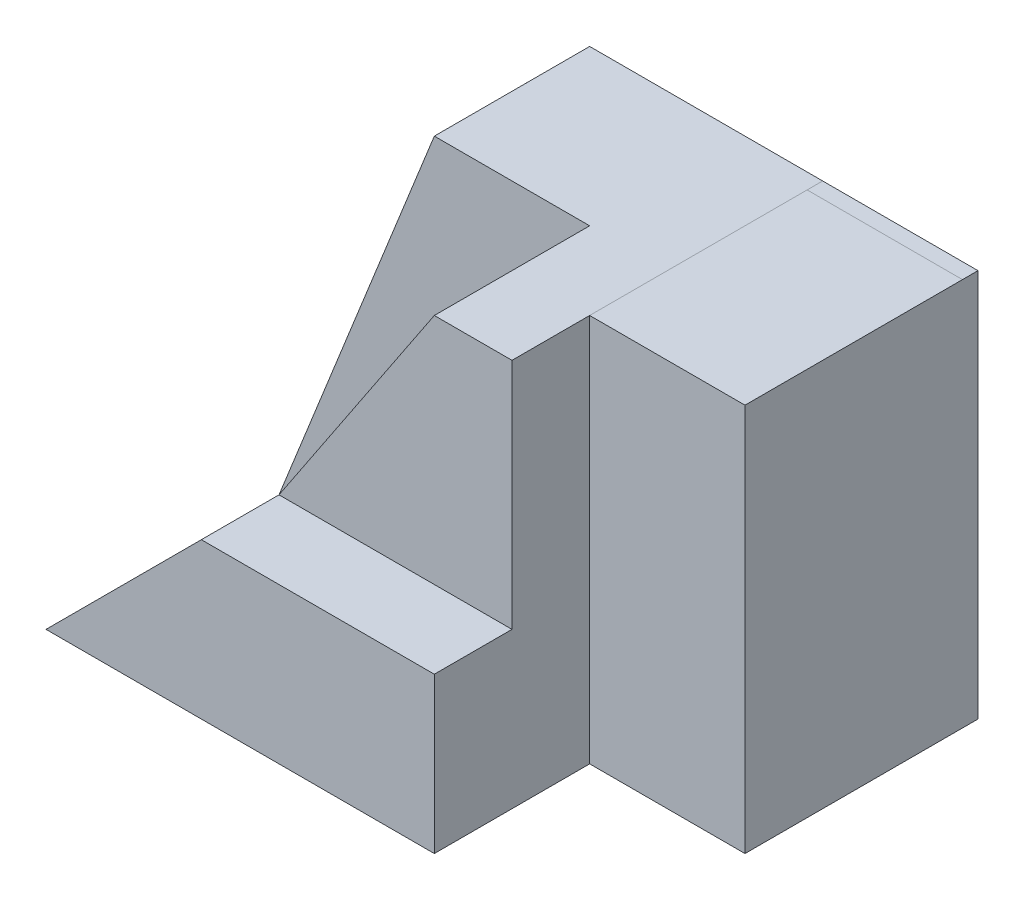
ISO-10303-21;
HEADER;
FILE_DESCRIPTION(('STEP AP214'),'2;1');
FILE_NAME('part.step','',(''),(''),'','','');
FILE_SCHEMA(('AUTOMOTIVE_DESIGN { 1 0 10303 214 1 1 1 1 }'));
ENDSEC;
DATA;
#1=APPLICATION_CONTEXT('core data for automotive mechanical design processes');
#2=APPLICATION_PROTOCOL_DEFINITION('international standard','automotive_design',2000,#1);
#3=PRODUCT_CONTEXT('',#1,'mechanical');
#4=PRODUCT('Part','Part','',(#3));
#5=PRODUCT_RELATED_PRODUCT_CATEGORY('part','',(#4));
#6=PRODUCT_DEFINITION_FORMATION('','',#4);
#7=PRODUCT_DEFINITION_CONTEXT('part definition',#1,'design');
#8=PRODUCT_DEFINITION('design','',#6,#7);
#9=PRODUCT_DEFINITION_SHAPE('','',#8);
#10=(LENGTH_UNIT() NAMED_UNIT(*) SI_UNIT(.MILLI.,.METRE.));
#11=(NAMED_UNIT(*) PLANE_ANGLE_UNIT() SI_UNIT($,.RADIAN.));
#12=(NAMED_UNIT(*) SI_UNIT($,.STERADIAN.) SOLID_ANGLE_UNIT());
#13=UNCERTAINTY_MEASURE_WITH_UNIT(LENGTH_MEASURE(1.E-05),#10,'distance_accuracy_value','');
#14=(GEOMETRIC_REPRESENTATION_CONTEXT(3) GLOBAL_UNCERTAINTY_ASSIGNED_CONTEXT((#13)) GLOBAL_UNIT_ASSIGNED_CONTEXT((#10,
#11,#12)) REPRESENTATION_CONTEXT('',''));
#15=CARTESIAN_POINT('',(0.,0.,0.));
#16=DIRECTION('',(0.,0.,1.));
#17=DIRECTION('',(1.,0.,0.));
#18=AXIS2_PLACEMENT_3D('',#15,#16,#17);
#19=CARTESIAN_POINT('',(0.,0.,50.));
#20=DIRECTION('',(0.,1.,0.));
#21=DIRECTION('',(0.,0.,1.));
#22=AXIS2_PLACEMENT_3D('',#19,#20,#21);
#23=PLANE('',#22);
#24=DIRECTION('',(-1.,0.,0.));
#25=VECTOR('',#24,1.);
#26=CARTESIAN_POINT('',(0.,0.,20.));
#27=LINE('',#26,#25);
#28=CARTESIAN_POINT('',(9.69545071876497,0.,20.));
#29=VERTEX_POINT('',#28);
#30=CARTESIAN_POINT('',(0.00628269227498889,0.,20.));
#31=VERTEX_POINT('',#30);
#32=EDGE_CURVE('E375',#29,#31,#27,.T.);
#33=ORIENTED_EDGE('',*,*,#32,.T.);
#34=DIRECTION('',(0.,0.,1.));
#35=VECTOR('',#34,1.);
#36=CARTESIAN_POINT('',(0.0062826922749892,0.,50.));
#37=LINE('',#36,#35);
#38=CARTESIAN_POINT('',(0.00628269227498889,0.,29.9987001326328));
#39=VERTEX_POINT('',#38);
#40=EDGE_CURVE('E374',#31,#39,#37,.T.);
#41=ORIENTED_EDGE('',*,*,#40,.T.);
#42=DIRECTION('',(0.979260419507103,0.,-0.202605604035952));
#43=VECTOR('',#42,1.);
#44=CARTESIAN_POINT('',(-3.96807297605473,0.,30.8209806157355));
#45=LINE('',#44,#43);
#46=CARTESIAN_POINT('',(9.69545071876497,0.,27.9940446788762));
#47=VERTEX_POINT('',#46);
#48=EDGE_CURVE('E365',#39,#47,#45,.T.);
#49=ORIENTED_EDGE('',*,*,#48,.T.);
#50=DIRECTION('',(0.,0.,1.));
#51=VECTOR('',#50,1.);
#52=CARTESIAN_POINT('',(9.69545071876497,0.,50.));
#53=LINE('',#52,#51);
#54=EDGE_CURVE('E40',#29,#47,#53,.T.);
#55=ORIENTED_EDGE('',*,*,#54,.F.);
#56=EDGE_LOOP('',(#33,#41,#49,#55));
#57=FACE_BOUND('',#56,.T.);
#58=DIRECTION('',(1.,0.,0.));
#59=VECTOR('',#58,1.);
#60=CARTESIAN_POINT('',(0.,0.,20.));
#61=LINE('',#60,#59);
#62=CARTESIAN_POINT('',(0.00107703296142621,0.,20.));
#63=VERTEX_POINT('',#62);
#64=CARTESIAN_POINT('',(0.00141421356236737,0.,20.));
#65=VERTEX_POINT('',#64);
#66=EDGE_CURVE('E467',#63,#65,#61,.T.);
#67=ORIENTED_EDGE('',*,*,#66,.F.);
#68=DIRECTION('',(0.,0.,1.));
#69=VECTOR('',#68,1.);
#70=CARTESIAN_POINT('',(0.0010770329614269,0.,50.));
#71=LINE('',#70,#69);
#72=CARTESIAN_POINT('',(0.0010770329614269,0.,0.));
#73=VERTEX_POINT('',#72);
#74=EDGE_CURVE('E389',#73,#63,#71,.T.);
#75=ORIENTED_EDGE('',*,*,#74,.F.);
#76=DIRECTION('',(1.,0.,0.));
#77=VECTOR('',#76,1.);
#78=CARTESIAN_POINT('',(0.,0.,0.));
#79=LINE('',#78,#77);
#80=CARTESIAN_POINT('',(70.,0.,0.));
#81=VERTEX_POINT('',#80);
#82=EDGE_CURVE('E334',#73,#81,#79,.T.);
#83=ORIENTED_EDGE('',*,*,#82,.T.);
#84=DIRECTION('',(0.,0.,-1.));
#85=VECTOR('',#84,1.);
#86=CARTESIAN_POINT('',(70.,0.,50.));
#87=LINE('',#86,#85);
#88=CARTESIAN_POINT('',(70.,0.,30.));
#89=VERTEX_POINT('',#88);
#90=EDGE_CURVE('E343',#89,#81,#87,.T.);
#91=ORIENTED_EDGE('',*,*,#90,.F.);
#92=DIRECTION('',(1.,0.,0.));
#93=VECTOR('',#92,1.);
#94=CARTESIAN_POINT('',(70.,0.,30.));
#95=LINE('',#94,#93);
#96=CARTESIAN_POINT('',(50.,0.,30.));
#97=VERTEX_POINT('',#96);
#98=EDGE_CURVE('E313',#97,#89,#95,.T.);
#99=ORIENTED_EDGE('',*,*,#98,.F.);
#100=DIRECTION('',(0.,0.,-1.));
#101=VECTOR('',#100,1.);
#102=CARTESIAN_POINT('',(50.,0.,50.));
#103=LINE('',#102,#101);
#104=CARTESIAN_POINT('',(50.,0.,50.));
#105=VERTEX_POINT('',#104);
#106=EDGE_CURVE('E310',#105,#97,#103,.T.);
#107=ORIENTED_EDGE('',*,*,#106,.F.);
#108=DIRECTION('',(1.,0.,0.));
#109=VECTOR('',#108,1.);
#110=CARTESIAN_POINT('',(0.,0.,50.));
#111=LINE('',#110,#109);
#112=CARTESIAN_POINT('',(0.00141421356237431,0.,50.));
#113=VERTEX_POINT('',#112);
#114=EDGE_CURVE('E335',#113,#105,#111,.T.);
#115=ORIENTED_EDGE('',*,*,#114,.F.);
#116=DIRECTION('',(0.,0.,-1.));
#117=VECTOR('',#116,1.);
#118=CARTESIAN_POINT('',(0.00141421356237064,0.,50.));
#119=LINE('',#118,#117);
#120=EDGE_CURVE('E239',#113,#65,#119,.T.);
#121=ORIENTED_EDGE('',*,*,#120,.T.);
#122=EDGE_LOOP('',(#67,#75,#83,#91,#99,#107,#115,#121));
#123=FACE_BOUND('',#122,.T.);
#124=ADVANCED_FACE('F33',(#57,#123),#23,.F.);
#125=CARTESIAN_POINT('',(0.000928476690885259,-0.000371390676354104,0.));
#126=DIRECTION('',(-0.92847669088526,0.371390676354104,0.));
#127=DIRECTION('',(-0.371390676354104,-0.928476690885259,0.));
#128=AXIS2_PLACEMENT_3D('',#125,#126,#127);
#129=PLANE('',#128);
#130=ORIENTED_EDGE('',*,*,#74,.T.);
#131=DIRECTION('',(0.371390676354104,0.928476690885259,0.));
#132=VECTOR('',#131,1.);
#133=CARTESIAN_POINT('',(0.00092847669088526,-0.000371390676354104,20.));
#134=LINE('',#133,#132);
#135=CARTESIAN_POINT('',(6.66759514335757,16.6662952759904,20.));
#136=VERTEX_POINT('',#135);
#137=EDGE_CURVE('E392',#63,#136,#134,.T.);
#138=ORIENTED_EDGE('',*,*,#137,.T.);
#139=DIRECTION('',(0.324442842261525,0.811107105653813,-0.486664263392287));
#140=VECTOR('',#139,1.);
#141=CARTESIAN_POINT('',(20.0009284766909,49.9996286093237,0.));
#142=LINE('',#141,#140);
#143=CARTESIAN_POINT('',(20.0009284766909,49.9996286093237,0.));
#144=VERTEX_POINT('',#143);
#145=EDGE_CURVE('E223',#136,#144,#142,.T.);
#146=ORIENTED_EDGE('',*,*,#145,.T.);
#147=DIRECTION('',(-0.371390676354104,-0.928476690885259,0.));
#148=VECTOR('',#147,1.);
#149=CARTESIAN_POINT('',(0.000928476690885259,-0.000371390676354104,0.));
#150=LINE('',#149,#148);
#151=EDGE_CURVE('E382',#144,#73,#150,.T.);
#152=ORIENTED_EDGE('',*,*,#151,.T.);
#153=EDGE_LOOP('',(#130,#138,#146,#152));
#154=FACE_BOUND('',#153,.T.);
#155=ADVANCED_FACE('F466',(#154),#129,.T.);
#156=CARTESIAN_POINT('',(0.,0.,20.));
#157=DIRECTION('',(0.,0.,-1.));
#158=DIRECTION('',(-1.,0.,0.));
#159=AXIS2_PLACEMENT_3D('',#156,#157,#158);
#160=PLANE('',#159);
#161=DIRECTION('',(-0.371390676354104,-0.928476690885259,0.));
#162=VECTOR('',#161,1.);
#163=CARTESIAN_POINT('',(20.,50.,20.));
#164=LINE('',#163,#162);
#165=CARTESIAN_POINT('',(20.,50.,20.));
#166=VERTEX_POINT('',#165);
#167=CARTESIAN_POINT('',(8.5236200484372,21.309050121093,20.));
#168=VERTEX_POINT('',#167);
#169=EDGE_CURVE('E295',#166,#168,#164,.T.);
#170=ORIENTED_EDGE('',*,*,#169,.T.);
#171=DIRECTION('',(-0.928476690885259,0.371390676354104,0.));
#172=VECTOR('',#171,1.);
#173=CARTESIAN_POINT('',(8.52371289610629,21.3090129820254,20.));
#174=LINE('',#173,#172);
#175=CARTESIAN_POINT('',(8.52371289610629,21.3090129820254,20.));
#176=VERTEX_POINT('',#175);
#177=EDGE_CURVE('E218',#176,#168,#174,.T.);
#178=ORIENTED_EDGE('',*,*,#177,.F.);
#179=DIRECTION('',(0.371390676354104,0.928476690885259,0.));
#180=VECTOR('',#179,1.);
#181=CARTESIAN_POINT('',(8.52371289610629,21.3090129820254,20.));
#182=LINE('',#181,#180);
#183=CARTESIAN_POINT('',(6.66675951433577,16.6666295275991,20.));
#184=VERTEX_POINT('',#183);
#185=EDGE_CURVE('E206',#184,#176,#182,.T.);
#186=ORIENTED_EDGE('',*,*,#185,.F.);
#187=DIRECTION('',(0.928476690885259,-0.371390676354104,0.));
#188=VECTOR('',#187,1.);
#189=CARTESIAN_POINT('',(6.66666666666668,16.6666666666667,20.));
#190=LINE('',#189,#188);
#191=EDGE_CURVE('E216',#184,#136,#190,.T.);
#192=ORIENTED_EDGE('',*,*,#191,.T.);
#193=ORIENTED_EDGE('',*,*,#137,.F.);
#194=ORIENTED_EDGE('',*,*,#66,.T.);
#195=DIRECTION('',(-0.707106781186546,-0.707106781186549,0.));
#196=VECTOR('',#195,1.);
#197=CARTESIAN_POINT('',(20.0007071067811,19.9992928932188,20.));
#198=LINE('',#197,#196);
#199=CARTESIAN_POINT('',(0.00280520748026022,0.00139099391788938,20.));
#200=VERTEX_POINT('',#199);
#201=EDGE_CURVE('E474',#200,#65,#198,.T.);
#202=ORIENTED_EDGE('',*,*,#201,.F.);
#203=DIRECTION('',(-0.928476690885259,0.371390676354104,0.));
#204=VECTOR('',#203,1.);
#205=CARTESIAN_POINT('',(8.35901374959393,-3.34109242292758,20.));
#206=LINE('',#205,#204);
#207=EDGE_CURVE('E370',#31,#200,#206,.T.);
#208=ORIENTED_EDGE('',*,*,#207,.F.);
#209=ORIENTED_EDGE('',*,*,#32,.F.);
#210=DIRECTION('',(-0.371390676354104,-0.928476690885259,0.));
#211=VECTOR('',#210,1.);
#212=CARTESIAN_POINT('',(8.35901374959393,-3.34109242292758,20.));
#213=LINE('',#212,#211);
#214=CARTESIAN_POINT('',(15.0248138380158,13.3234077981271,20.));
#215=VERTEX_POINT('',#214);
#216=EDGE_CURVE('E55',#215,#29,#213,.T.);
#217=ORIENTED_EDGE('',*,*,#216,.F.);
#218=DIRECTION('',(-0.928476690885259,0.371390676354104,0.));
#219=VECTOR('',#218,1.);
#220=CARTESIAN_POINT('',(15.0248138380158,13.3234077981271,20.));
#221=LINE('',#220,#219);
#222=CARTESIAN_POINT('',(13.8105339620683,13.809119748506,20.));
#223=VERTEX_POINT('',#222);
#224=EDGE_CURVE('E369',#215,#223,#221,.T.);
#225=ORIENTED_EDGE('',*,*,#224,.T.);
#226=CARTESIAN_POINT('',(20.0007071067811,19.9992928932188,20.));
#227=VERTEX_POINT('',#226);
#228=EDGE_CURVE('E471',#227,#223,#198,.T.);
#229=ORIENTED_EDGE('',*,*,#228,.F.);
#230=DIRECTION('',(-0.707106781186549,0.707106781186546,0.));
#231=VECTOR('',#230,1.);
#232=CARTESIAN_POINT('',(20.0007071067811,19.9992928932188,20.));
#233=LINE('',#232,#231);
#234=CARTESIAN_POINT('',(19.9999999999999,20.,20.));
#235=VERTEX_POINT('',#234);
#236=EDGE_CURVE('E237',#227,#235,#233,.T.);
#237=ORIENTED_EDGE('',*,*,#236,.T.);
#238=DIRECTION('',(0.55470019622523,0.832050294337843,0.));
#239=VECTOR('',#238,1.);
#240=CARTESIAN_POINT('',(19.9999999999999,20.,20.));
#241=LINE('',#240,#239);
#242=CARTESIAN_POINT('',(39.9999333333333,49.9999,20.));
#243=VERTEX_POINT('',#242);
#244=EDGE_CURVE('E299',#235,#243,#241,.T.);
#245=ORIENTED_EDGE('',*,*,#244,.T.);
#246=DIRECTION('',(1.,0.,0.));
#247=VECTOR('',#246,1.);
#248=CARTESIAN_POINT('',(0.,49.9999,20.));
#249=LINE('',#248,#247);
#250=CARTESIAN_POINT('',(20.,49.9999,20.));
#251=VERTEX_POINT('',#250);
#252=EDGE_CURVE('E254',#251,#243,#249,.T.);
#253=ORIENTED_EDGE('',*,*,#252,.F.);
#254=DIRECTION('',(0.,1.,0.));
#255=VECTOR('',#254,1.);
#256=CARTESIAN_POINT('',(20.,0.,20.));
#257=LINE('',#256,#255);
#258=EDGE_CURVE('E251',#251,#166,#257,.T.);
#259=ORIENTED_EDGE('',*,*,#258,.T.);
#260=EDGE_LOOP('',(#170,#178,#186,#192,#193,#194,#202,#208,#209,#217,#225,#229,#237,#245,#253,#259));
#261=FACE_BOUND('',#260,.T.);
#262=ADVANCED_FACE('F215',(#261),#160,.F.);
#263=CARTESIAN_POINT('',(0.,50.,50.));
#264=DIRECTION('',(0.,-1.,0.));
#265=DIRECTION('',(0.,0.,-1.));
#266=AXIS2_PLACEMENT_3D('',#263,#264,#265);
#267=PLANE('',#266);
#268=DIRECTION('',(1.,0.,0.));
#269=VECTOR('',#268,1.);
#270=CARTESIAN_POINT('',(70.,50.,2.));
#271=LINE('',#270,#269);
#272=CARTESIAN_POINT('',(50.,50.,2.00000000000001));
#273=VERTEX_POINT('',#272);
#274=CARTESIAN_POINT('',(70.,50.,2.));
#275=VERTEX_POINT('',#274);
#276=EDGE_CURVE('E258',#273,#275,#271,.T.);
#277=ORIENTED_EDGE('',*,*,#276,.F.);
#278=DIRECTION('',(0.,0.,-1.));
#279=VECTOR('',#278,1.);
#280=CARTESIAN_POINT('',(50.,50.,0.));
#281=LINE('',#280,#279);
#282=CARTESIAN_POINT('',(50.,50.,30.));
#283=VERTEX_POINT('',#282);
#284=EDGE_CURVE('E276',#283,#273,#281,.T.);
#285=ORIENTED_EDGE('',*,*,#284,.F.);
#286=DIRECTION('',(1.,0.,0.));
#287=VECTOR('',#286,1.);
#288=CARTESIAN_POINT('',(0.,50.,30.));
#289=LINE('',#288,#287);
#290=CARTESIAN_POINT('',(70.,50.,30.));
#291=VERTEX_POINT('',#290);
#292=EDGE_CURVE('E349',#283,#291,#289,.T.);
#293=ORIENTED_EDGE('',*,*,#292,.T.);
#294=DIRECTION('',(0.,0.,-1.));
#295=VECTOR('',#294,1.);
#296=CARTESIAN_POINT('',(70.,50.,50.));
#297=LINE('',#296,#295);
#298=EDGE_CURVE('E337',#291,#275,#297,.T.);
#299=ORIENTED_EDGE('',*,*,#298,.T.);
#300=EDGE_LOOP('',(#277,#285,#293,#299));
#301=FACE_BOUND('',#300,.T.);
#302=ADVANCED_FACE('F452',(#301),#267,.F.);
#303=CARTESIAN_POINT('',(70.,0.,50.));
#304=DIRECTION('',(-1.,0.,0.));
#305=DIRECTION('',(0.,0.,1.));
#306=AXIS2_PLACEMENT_3D('',#303,#304,#305);
#307=PLANE('',#306);
#308=ORIENTED_EDGE('',*,*,#298,.F.);
#309=DIRECTION('',(0.,-1.,0.));
#310=VECTOR('',#309,1.);
#311=CARTESIAN_POINT('',(70.,121.,30.));
#312=LINE('',#311,#310);
#313=EDGE_CURVE('E316',#291,#89,#312,.T.);
#314=ORIENTED_EDGE('',*,*,#313,.T.);
#315=ORIENTED_EDGE('',*,*,#90,.T.);
#316=DIRECTION('',(0.,1.,0.));
#317=VECTOR('',#316,1.);
#318=CARTESIAN_POINT('',(70.,0.,0.));
#319=LINE('',#318,#317);
#320=CARTESIAN_POINT('',(70.,50.0001,0.));
#321=VERTEX_POINT('',#320);
#322=EDGE_CURVE('E338',#81,#321,#319,.T.);
#323=ORIENTED_EDGE('',*,*,#322,.T.);
#324=DIRECTION('',(0.,0.,-1.));
#325=VECTOR('',#324,1.);
#326=CARTESIAN_POINT('',(70.,50.0001,0.));
#327=LINE('',#326,#325);
#328=CARTESIAN_POINT('',(70.,50.0001,2.));
#329=VERTEX_POINT('',#328);
#330=EDGE_CURVE('E264',#329,#321,#327,.T.);
#331=ORIENTED_EDGE('',*,*,#330,.F.);
#332=DIRECTION('',(0.,-1.,0.));
#333=VECTOR('',#332,1.);
#334=CARTESIAN_POINT('',(70.,50.0001,2.));
#335=LINE('',#334,#333);
#336=EDGE_CURVE('E270',#329,#275,#335,.T.);
#337=ORIENTED_EDGE('',*,*,#336,.T.);
#338=EDGE_LOOP('',(#308,#314,#315,#323,#331,#337));
#339=FACE_BOUND('',#338,.T.);
#340=ADVANCED_FACE('F446',(#339),#307,.F.);
#341=CARTESIAN_POINT('',(0.,0.,50.));
#342=DIRECTION('',(0.,0.,-1.));
#343=DIRECTION('',(-1.,0.,0.));
#344=AXIS2_PLACEMENT_3D('',#341,#342,#343);
#345=PLANE('',#344);
#346=DIRECTION('',(1.,0.,0.));
#347=VECTOR('',#346,1.);
#348=CARTESIAN_POINT('',(-51.,20.,50.));
#349=LINE('',#348,#347);
#350=CARTESIAN_POINT('',(19.9999999999999,20.,50.));
#351=VERTEX_POINT('',#350);
#352=CARTESIAN_POINT('',(50.,20.,50.));
#353=VERTEX_POINT('',#352);
#354=EDGE_CURVE('E328',#351,#353,#349,.T.);
#355=ORIENTED_EDGE('',*,*,#354,.F.);
#356=DIRECTION('',(-0.707106781186549,0.707106781186546,0.));
#357=VECTOR('',#356,1.);
#358=CARTESIAN_POINT('',(20.0007071067811,19.9992928932188,50.));
#359=LINE('',#358,#357);
#360=CARTESIAN_POINT('',(20.0007071067811,19.9992928932188,50.));
#361=VERTEX_POINT('',#360);
#362=EDGE_CURVE('E236',#361,#351,#359,.T.);
#363=ORIENTED_EDGE('',*,*,#362,.F.);
#364=DIRECTION('',(0.707106781186546,0.707106781186549,0.));
#365=VECTOR('',#364,1.);
#366=CARTESIAN_POINT('',(20.0007071067811,19.9992928932188,50.));
#367=LINE('',#366,#365);
#368=EDGE_CURVE('E224',#113,#361,#367,.T.);
#369=ORIENTED_EDGE('',*,*,#368,.F.);
#370=ORIENTED_EDGE('',*,*,#114,.T.);
#371=DIRECTION('',(0.,-1.,0.));
#372=VECTOR('',#371,1.);
#373=CARTESIAN_POINT('',(50.,121.,50.));
#374=LINE('',#373,#372);
#375=EDGE_CURVE('E315',#353,#105,#374,.T.);
#376=ORIENTED_EDGE('',*,*,#375,.F.);
#377=EDGE_LOOP('',(#355,#363,#369,#370,#376));
#378=FACE_BOUND('',#377,.T.);
#379=ADVANCED_FACE('F433',(#378),#345,.F.);
#380=CARTESIAN_POINT('',(0.,0.,0.));
#381=DIRECTION('',(0.,0.,-1.));
#382=DIRECTION('',(-1.,0.,0.));
#383=AXIS2_PLACEMENT_3D('',#380,#381,#382);
#384=PLANE('',#383);
#385=DIRECTION('',(-0.928476690885259,0.371390676354104,0.));
#386=VECTOR('',#385,1.);
#387=CARTESIAN_POINT('',(20.0009284766909,49.9996286093237,0.));
#388=LINE('',#387,#386);
#389=CARTESIAN_POINT('',(20.00025,49.9999,0.));
#390=VERTEX_POINT('',#389);
#391=EDGE_CURVE('E385',#144,#390,#388,.T.);
#392=ORIENTED_EDGE('',*,*,#391,.T.);
#393=DIRECTION('',(-1.,0.,0.));
#394=VECTOR('',#393,1.);
#395=CARTESIAN_POINT('',(20.,49.9999,0.));
#396=LINE('',#395,#394);
#397=CARTESIAN_POINT('',(50.,49.9999,0.));
#398=VERTEX_POINT('',#397);
#399=EDGE_CURVE('E287',#398,#390,#396,.T.);
#400=ORIENTED_EDGE('',*,*,#399,.F.);
#401=DIRECTION('',(0.,1.,0.));
#402=VECTOR('',#401,1.);
#403=CARTESIAN_POINT('',(50.,49.9999,0.));
#404=LINE('',#403,#402);
#405=CARTESIAN_POINT('',(50.,50.0001,0.));
#406=VERTEX_POINT('',#405);
#407=EDGE_CURVE('E293',#398,#406,#404,.T.);
#408=ORIENTED_EDGE('',*,*,#407,.T.);
#409=DIRECTION('',(-1.,0.,0.));
#410=VECTOR('',#409,1.);
#411=CARTESIAN_POINT('',(50.,50.0001,0.));
#412=LINE('',#411,#410);
#413=EDGE_CURVE('E267',#321,#406,#412,.T.);
#414=ORIENTED_EDGE('',*,*,#413,.F.);
#415=ORIENTED_EDGE('',*,*,#322,.F.);
#416=ORIENTED_EDGE('',*,*,#82,.F.);
#417=ORIENTED_EDGE('',*,*,#151,.F.);
#418=EDGE_LOOP('',(#392,#400,#408,#414,#415,#416,#417));
#419=FACE_BOUND('',#418,.T.);
#420=ADVANCED_FACE('F461',(#419),#384,.T.);
#421=CARTESIAN_POINT('',(0.,0.,0.));
#422=DIRECTION('',(0.928476690885259,-0.371390676354104,0.));
#423=DIRECTION('',(0.371390676354104,0.928476690885259,0.));
#424=AXIS2_PLACEMENT_3D('',#421,#422,#423);
#425=PLANE('',#424);
#426=DIRECTION('',(0.324442842261525,0.811107105653813,-0.486664263392287));
#427=VECTOR('',#426,1.);
#428=CARTESIAN_POINT('',(20.,50.,0.));
#429=LINE('',#428,#427);
#430=CARTESIAN_POINT('',(8.5236200484372,21.309050121093,17.2145699273442));
#431=VERTEX_POINT('',#430);
#432=CARTESIAN_POINT('',(20.,50.,0.));
#433=VERTEX_POINT('',#432);
#434=EDGE_CURVE('E377',#431,#433,#429,.T.);
#435=ORIENTED_EDGE('',*,*,#434,.F.);
#436=DIRECTION('',(0.,0.,-1.));
#437=VECTOR('',#436,1.);
#438=CARTESIAN_POINT('',(8.5236200484372,21.309050121093,17.2145699273442));
#439=LINE('',#438,#437);
#440=EDGE_CURVE('E210',#168,#431,#439,.T.);
#441=ORIENTED_EDGE('',*,*,#440,.F.);
#442=ORIENTED_EDGE('',*,*,#169,.F.);
#443=DIRECTION('',(0.,0.,1.));
#444=VECTOR('',#443,1.);
#445=CARTESIAN_POINT('',(20.,50.,0.));
#446=LINE('',#445,#444);
#447=EDGE_CURVE('E331',#433,#166,#446,.T.);
#448=ORIENTED_EDGE('',*,*,#447,.F.);
#449=EDGE_LOOP('',(#435,#441,#442,#448));
#450=FACE_BOUND('',#449,.T.);
#451=ADVANCED_FACE('F495',(#450),#425,.F.);
#452=CARTESIAN_POINT('',(-51.,50.,40.));
#453=DIRECTION('',(0.,0.,-1.));
#454=DIRECTION('',(0.,1.,0.));
#455=AXIS2_PLACEMENT_3D('',#452,#453,#454);
#456=PLANE('',#455);
#457=DIRECTION('',(1.,0.,0.));
#458=VECTOR('',#457,1.);
#459=CARTESIAN_POINT('',(50.,49.9999,40.));
#460=LINE('',#459,#458);
#461=CARTESIAN_POINT('',(40.,49.9999,40.));
#462=VERTEX_POINT('',#461);
#463=CARTESIAN_POINT('',(50.,49.9999,40.));
#464=VERTEX_POINT('',#463);
#465=EDGE_CURVE('E281',#462,#464,#460,.T.);
#466=ORIENTED_EDGE('',*,*,#465,.F.);
#467=DIRECTION('',(0.,1.,0.));
#468=VECTOR('',#467,1.);
#469=CARTESIAN_POINT('',(40.,49.9999,40.));
#470=LINE('',#469,#468);
#471=CARTESIAN_POINT('',(40.,50.,40.));
#472=VERTEX_POINT('',#471);
#473=EDGE_CURVE('E290',#462,#472,#470,.T.);
#474=ORIENTED_EDGE('',*,*,#473,.T.);
#475=DIRECTION('',(-0.55470019622523,-0.832050294337843,0.));
#476=VECTOR('',#475,1.);
#477=CARTESIAN_POINT('',(11.9999999999999,7.99999999999993,40.));
#478=LINE('',#477,#476);
#479=CARTESIAN_POINT('',(19.9999999999999,20.,40.));
#480=VERTEX_POINT('',#479);
#481=EDGE_CURVE('E305',#472,#480,#478,.T.);
#482=ORIENTED_EDGE('',*,*,#481,.T.);
#483=DIRECTION('',(1.,0.,0.));
#484=VECTOR('',#483,1.);
#485=CARTESIAN_POINT('',(-51.,20.,40.));
#486=LINE('',#485,#484);
#487=CARTESIAN_POINT('',(50.,20.,40.));
#488=VERTEX_POINT('',#487);
#489=EDGE_CURVE('E329',#480,#488,#486,.T.);
#490=ORIENTED_EDGE('',*,*,#489,.T.);
#491=DIRECTION('',(0.,1.,0.));
#492=VECTOR('',#491,1.);
#493=CARTESIAN_POINT('',(50.,50.,40.));
#494=LINE('',#493,#492);
#495=EDGE_CURVE('E319',#488,#464,#494,.T.);
#496=ORIENTED_EDGE('',*,*,#495,.T.);
#497=EDGE_LOOP('',(#466,#474,#482,#490,#496));
#498=FACE_BOUND('',#497,.T.);
#499=ADVANCED_FACE('F425',(#498),#456,.F.);
#500=CARTESIAN_POINT('',(-51.,20.,50.));
#501=DIRECTION('',(0.,-1.,0.));
#502=DIRECTION('',(0.,0.,-1.));
#503=AXIS2_PLACEMENT_3D('',#500,#501,#502);
#504=PLANE('',#503);
#505=ORIENTED_EDGE('',*,*,#489,.F.);
#506=DIRECTION('',(0.,0.,1.));
#507=VECTOR('',#506,1.);
#508=CARTESIAN_POINT('',(19.9999999999999,20.,50.));
#509=LINE('',#508,#507);
#510=EDGE_CURVE('E352',#480,#351,#509,.T.);
#511=ORIENTED_EDGE('',*,*,#510,.T.);
#512=ORIENTED_EDGE('',*,*,#354,.T.);
#513=DIRECTION('',(0.,0.,-1.));
#514=VECTOR('',#513,1.);
#515=CARTESIAN_POINT('',(50.,20.,50.));
#516=LINE('',#515,#514);
#517=EDGE_CURVE('E346',#353,#488,#516,.T.);
#518=ORIENTED_EDGE('',*,*,#517,.T.);
#519=EDGE_LOOP('',(#505,#511,#512,#518));
#520=FACE_BOUND('',#519,.T.);
#521=ADVANCED_FACE('F428',(#520),#504,.F.);
#522=CARTESIAN_POINT('',(70.,121.,30.));
#523=DIRECTION('',(0.,0.,-1.));
#524=DIRECTION('',(-1.,0.,0.));
#525=AXIS2_PLACEMENT_3D('',#522,#523,#524);
#526=PLANE('',#525);
#527=DIRECTION('',(0.,-1.,0.));
#528=VECTOR('',#527,1.);
#529=CARTESIAN_POINT('',(50.,121.,30.));
#530=LINE('',#529,#528);
#531=CARTESIAN_POINT('',(50.,49.9999,30.));
#532=VERTEX_POINT('',#531);
#533=EDGE_CURVE('E320',#283,#532,#530,.T.);
#534=ORIENTED_EDGE('',*,*,#533,.T.);
#535=EDGE_CURVE('E323',#532,#97,#530,.T.);
#536=ORIENTED_EDGE('',*,*,#535,.T.);
#537=ORIENTED_EDGE('',*,*,#98,.T.);
#538=ORIENTED_EDGE('',*,*,#313,.F.);
#539=ORIENTED_EDGE('',*,*,#292,.F.);
#540=EDGE_LOOP('',(#534,#536,#537,#538,#539));
#541=FACE_BOUND('',#540,.T.);
#542=ADVANCED_FACE('F442',(#541),#526,.F.);
#543=CARTESIAN_POINT('',(50.,121.,50.));
#544=DIRECTION('',(-1.,0.,0.));
#545=DIRECTION('',(0.,0.,1.));
#546=AXIS2_PLACEMENT_3D('',#543,#544,#545);
#547=PLANE('',#546);
#548=ORIENTED_EDGE('',*,*,#535,.F.);
#549=DIRECTION('',(0.,0.,-1.));
#550=VECTOR('',#549,1.);
#551=CARTESIAN_POINT('',(50.,49.9999,0.));
#552=LINE('',#551,#550);
#553=EDGE_CURVE('E284',#464,#532,#552,.T.);
#554=ORIENTED_EDGE('',*,*,#553,.F.);
#555=ORIENTED_EDGE('',*,*,#495,.F.);
#556=ORIENTED_EDGE('',*,*,#517,.F.);
#557=ORIENTED_EDGE('',*,*,#375,.T.);
#558=ORIENTED_EDGE('',*,*,#106,.T.);
#559=EDGE_LOOP('',(#548,#554,#555,#556,#557,#558));
#560=FACE_BOUND('',#559,.T.);
#561=ADVANCED_FACE('F423',(#560),#547,.F.);
#562=CARTESIAN_POINT('',(19.9999999999999,20.,20.));
#563=DIRECTION('',(0.832050294337843,-0.55470019622523,0.));
#564=DIRECTION('',(0.55470019622523,0.832050294337843,0.));
#565=AXIS2_PLACEMENT_3D('',#562,#563,#564);
#566=PLANE('',#565);
#567=DIRECTION('',(0.,0.,1.));
#568=VECTOR('',#567,1.);
#569=CARTESIAN_POINT('',(40.,50.,20.));
#570=LINE('',#569,#568);
#571=CARTESIAN_POINT('',(40.,50.,30.));
#572=VERTEX_POINT('',#571);
#573=EDGE_CURVE('E303',#572,#472,#570,.T.);
#574=ORIENTED_EDGE('',*,*,#573,.F.);
#575=DIRECTION('',(-0.55470019622523,-0.832050294337843,0.));
#576=VECTOR('',#575,1.);
#577=CARTESIAN_POINT('',(19.9999999999999,20.,30.));
#578=LINE('',#577,#576);
#579=CARTESIAN_POINT('',(39.9999333333333,49.9999,30.));
#580=VERTEX_POINT('',#579);
#581=EDGE_CURVE('E248',#572,#580,#578,.T.);
#582=ORIENTED_EDGE('',*,*,#581,.T.);
#583=DIRECTION('',(0.,0.,1.));
#584=VECTOR('',#583,1.);
#585=CARTESIAN_POINT('',(39.9999333333333,49.9999,20.));
#586=LINE('',#585,#584);
#587=EDGE_CURVE('E256',#243,#580,#586,.T.);
#588=ORIENTED_EDGE('',*,*,#587,.F.);
#589=ORIENTED_EDGE('',*,*,#244,.F.);
#590=DIRECTION('',(0.,0.,1.));
#591=VECTOR('',#590,1.);
#592=CARTESIAN_POINT('',(19.9999999999999,20.,20.));
#593=LINE('',#592,#591);
#594=EDGE_CURVE('E302',#235,#480,#593,.T.);
#595=ORIENTED_EDGE('',*,*,#594,.T.);
#596=ORIENTED_EDGE('',*,*,#481,.F.);
#597=EDGE_LOOP('',(#574,#582,#588,#589,#595,#596));
#598=FACE_BOUND('',#597,.T.);
#599=ADVANCED_FACE('F409',(#598),#566,.F.);
#600=CARTESIAN_POINT('',(50.,49.9999,0.));
#601=DIRECTION('',(1.,0.,0.));
#602=DIRECTION('',(0.,0.,-1.));
#603=AXIS2_PLACEMENT_3D('',#600,#601,#602);
#604=PLANE('',#603);
#605=ORIENTED_EDGE('',*,*,#284,.T.);
#606=DIRECTION('',(0.,-1.,0.));
#607=VECTOR('',#606,1.);
#608=CARTESIAN_POINT('',(50.,50.0001,2.00000000000001));
#609=LINE('',#608,#607);
#610=CARTESIAN_POINT('',(50.,50.0001,2.00000000000001));
#611=VERTEX_POINT('',#610);
#612=EDGE_CURVE('E274',#611,#273,#609,.T.);
#613=ORIENTED_EDGE('',*,*,#612,.F.);
#614=DIRECTION('',(0.,0.,1.));
#615=VECTOR('',#614,1.);
#616=CARTESIAN_POINT('',(50.,50.0001,2.00000000000001));
#617=LINE('',#616,#615);
#618=EDGE_CURVE('E259',#406,#611,#617,.T.);
#619=ORIENTED_EDGE('',*,*,#618,.F.);
#620=ORIENTED_EDGE('',*,*,#407,.F.);
#621=EDGE_CURVE('E283',#532,#398,#552,.T.);
#622=ORIENTED_EDGE('',*,*,#621,.F.);
#623=ORIENTED_EDGE('',*,*,#533,.F.);
#624=EDGE_LOOP('',(#605,#613,#619,#620,#622,#623));
#625=FACE_BOUND('',#624,.T.);
#626=ADVANCED_FACE('F455',(#625),#604,.F.);
#627=CARTESIAN_POINT('',(20.,49.9999,10.));
#628=DIRECTION('',(-1.,0.,0.));
#629=DIRECTION('',(0.,0.,1.));
#630=AXIS2_PLACEMENT_3D('',#627,#628,#629);
#631=PLANE('',#630);
#632=DIRECTION('',(0.,0.,1.));
#633=VECTOR('',#632,1.);
#634=CARTESIAN_POINT('',(20.,49.9999,10.));
#635=LINE('',#634,#633);
#636=CARTESIAN_POINT('',(20.,49.9999,5.17241379388925E-05));
#637=VERTEX_POINT('',#636);
#638=EDGE_CURVE('E277',#637,#251,#635,.T.);
#639=ORIENTED_EDGE('',*,*,#638,.F.);
#640=DIRECTION('',(0.,0.888217643155949,-0.459422918873767));
#641=VECTOR('',#640,1.);
#642=CARTESIAN_POINT('',(20.,45.919245684803,2.11073499061914));
#643=LINE('',#642,#641);
#644=EDGE_CURVE('E225',#637,#433,#643,.T.);
#645=ORIENTED_EDGE('',*,*,#644,.T.);
#646=ORIENTED_EDGE('',*,*,#447,.T.);
#647=ORIENTED_EDGE('',*,*,#258,.F.);
#648=EDGE_LOOP('',(#639,#645,#646,#647));
#649=FACE_BOUND('',#648,.T.);
#650=ADVANCED_FACE('F400',(#649),#631,.F.);
#651=CARTESIAN_POINT('',(40.,49.9999,40.));
#652=DIRECTION('',(-1.,0.,0.));
#653=DIRECTION('',(0.,0.,1.));
#654=AXIS2_PLACEMENT_3D('',#651,#652,#653);
#655=PLANE('',#654);
#656=DIRECTION('',(0.,0.,1.));
#657=VECTOR('',#656,1.);
#658=CARTESIAN_POINT('',(40.,49.9999,40.));
#659=LINE('',#658,#657);
#660=CARTESIAN_POINT('',(40.,49.9999,30.));
#661=VERTEX_POINT('',#660);
#662=EDGE_CURVE('E279',#661,#462,#659,.T.);
#663=ORIENTED_EDGE('',*,*,#662,.F.);
#664=DIRECTION('',(0.,1.,0.));
#665=VECTOR('',#664,1.);
#666=CARTESIAN_POINT('',(40.,49.9999,30.));
#667=LINE('',#666,#665);
#668=EDGE_CURVE('E245',#661,#572,#667,.T.);
#669=ORIENTED_EDGE('',*,*,#668,.T.);
#670=ORIENTED_EDGE('',*,*,#573,.T.);
#671=ORIENTED_EDGE('',*,*,#473,.F.);
#672=EDGE_LOOP('',(#663,#669,#670,#671));
#673=FACE_BOUND('',#672,.T.);
#674=ADVANCED_FACE('F415',(#673),#655,.F.);
#675=CARTESIAN_POINT('',(0.,49.9999,0.));
#676=DIRECTION('',(0.,-1.,0.));
#677=DIRECTION('',(0.,0.,-1.));
#678=AXIS2_PLACEMENT_3D('',#675,#676,#677);
#679=PLANE('',#678);
#680=ORIENTED_EDGE('',*,*,#399,.T.);
#681=DIRECTION('',(-0.979260419507103,0.,0.202605604035952));
#682=VECTOR('',#681,1.);
#683=CARTESIAN_POINT('',(0.82099087799316,49.9999,3.96812257696694));
#684=LINE('',#683,#682);
#685=EDGE_CURVE('E230',#390,#637,#684,.T.);
#686=ORIENTED_EDGE('',*,*,#685,.T.);
#687=ORIENTED_EDGE('',*,*,#638,.T.);
#688=ORIENTED_EDGE('',*,*,#252,.T.);
#689=ORIENTED_EDGE('',*,*,#587,.T.);
#690=DIRECTION('',(1.,0.,0.));
#691=VECTOR('',#690,1.);
#692=CARTESIAN_POINT('',(20.,49.9999,30.));
#693=LINE('',#692,#691);
#694=EDGE_CURVE('E242',#580,#661,#693,.T.);
#695=ORIENTED_EDGE('',*,*,#694,.T.);
#696=ORIENTED_EDGE('',*,*,#662,.T.);
#697=ORIENTED_EDGE('',*,*,#465,.T.);
#698=ORIENTED_EDGE('',*,*,#553,.T.);
#699=ORIENTED_EDGE('',*,*,#621,.T.);
#700=EDGE_LOOP('',(#680,#686,#687,#688,#689,#695,#696,#697,#698,#699));
#701=FACE_BOUND('',#700,.T.);
#702=ADVANCED_FACE('F396',(#701),#679,.F.);
#703=CARTESIAN_POINT('',(70.,50.0001,2.));
#704=DIRECTION('',(0.,0.,-1.));
#705=DIRECTION('',(-1.,0.,0.));
#706=AXIS2_PLACEMENT_3D('',#703,#704,#705);
#707=PLANE('',#706);
#708=ORIENTED_EDGE('',*,*,#276,.T.);
#709=ORIENTED_EDGE('',*,*,#336,.F.);
#710=DIRECTION('',(1.,0.,0.));
#711=VECTOR('',#710,1.);
#712=CARTESIAN_POINT('',(70.,50.0001,2.));
#713=LINE('',#712,#711);
#714=EDGE_CURVE('E262',#611,#329,#713,.T.);
#715=ORIENTED_EDGE('',*,*,#714,.F.);
#716=ORIENTED_EDGE('',*,*,#612,.T.);
#717=EDGE_LOOP('',(#708,#709,#715,#716));
#718=FACE_BOUND('',#717,.T.);
#719=ADVANCED_FACE('F532',(#718),#707,.F.);
#720=CARTESIAN_POINT('',(0.,50.0001,0.));
#721=DIRECTION('',(0.,-1.,0.));
#722=DIRECTION('',(0.,0.,-1.));
#723=AXIS2_PLACEMENT_3D('',#720,#721,#722);
#724=PLANE('',#723);
#725=ORIENTED_EDGE('',*,*,#618,.T.);
#726=ORIENTED_EDGE('',*,*,#714,.T.);
#727=ORIENTED_EDGE('',*,*,#330,.T.);
#728=ORIENTED_EDGE('',*,*,#413,.T.);
#729=EDGE_LOOP('',(#725,#726,#727,#728));
#730=FACE_BOUND('',#729,.T.);
#731=ADVANCED_FACE('F529',(#730),#724,.F.);
#732=CARTESIAN_POINT('',(20.,49.9999,30.));
#733=DIRECTION('',(0.,0.,1.));
#734=DIRECTION('',(1.,0.,0.));
#735=AXIS2_PLACEMENT_3D('',#732,#733,#734);
#736=PLANE('',#735);
#737=ORIENTED_EDGE('',*,*,#668,.F.);
#738=ORIENTED_EDGE('',*,*,#694,.F.);
#739=ORIENTED_EDGE('',*,*,#581,.F.);
#740=EDGE_LOOP('',(#737,#738,#739));
#741=FACE_BOUND('',#740,.T.);
#742=ADVANCED_FACE('F412',(#741),#736,.F.);
#743=CARTESIAN_POINT('',(0.000707106781185322,-0.00070710678118532,0.));
#744=DIRECTION('',(0.707106781186549,-0.707106781186546,0.));
#745=DIRECTION('',(0.707106781186546,0.707106781186549,0.));
#746=AXIS2_PLACEMENT_3D('',#743,#744,#745);
#747=PLANE('',#746);
#748=ORIENTED_EDGE('',*,*,#368,.T.);
#749=DIRECTION('',(0.,0.,-1.));
#750=VECTOR('',#749,1.);
#751=CARTESIAN_POINT('',(20.0007071067811,19.9992928932188,20.));
#752=LINE('',#751,#750);
#753=EDGE_CURVE('E227',#361,#227,#752,.T.);
#754=ORIENTED_EDGE('',*,*,#753,.T.);
#755=ORIENTED_EDGE('',*,*,#228,.T.);
#756=DIRECTION('',(0.629394583083824,0.629394583083825,-0.455768491198632));
#757=VECTOR('',#756,1.);
#758=CARTESIAN_POINT('',(14.0991470687114,14.097732855149,19.7910043020861));
#759=LINE('',#758,#757);
#760=CARTESIAN_POINT('',(0.00280520748026196,0.00139099391789068,29.9987001326328));
#761=VERTEX_POINT('',#760);
#762=EDGE_CURVE('E470',#761,#223,#759,.T.);
#763=ORIENTED_EDGE('',*,*,#762,.F.);
#764=DIRECTION('',(0.,0.,1.));
#765=VECTOR('',#764,1.);
#766=CARTESIAN_POINT('',(0.00280520748026196,0.00139099391789068,29.9987001326328));
#767=LINE('',#766,#765);
#768=EDGE_CURVE('E11',#200,#761,#767,.T.);
#769=ORIENTED_EDGE('',*,*,#768,.F.);
#770=ORIENTED_EDGE('',*,*,#201,.T.);
#771=ORIENTED_EDGE('',*,*,#120,.F.);
#772=EDGE_LOOP('',(#748,#754,#755,#763,#769,#770,#771));
#773=FACE_BOUND('',#772,.T.);
#774=ADVANCED_FACE('F521',(#773),#747,.F.);
#775=CARTESIAN_POINT('',(20.0007071067811,19.9992928932188,20.));
#776=DIRECTION('',(0.707106781186546,0.707106781186549,0.));
#777=DIRECTION('',(-0.707106781186549,0.707106781186546,0.));
#778=AXIS2_PLACEMENT_3D('',#775,#776,#777);
#779=PLANE('',#778);
#780=ORIENTED_EDGE('',*,*,#510,.F.);
#781=ORIENTED_EDGE('',*,*,#594,.F.);
#782=ORIENTED_EDGE('',*,*,#236,.F.);
#783=ORIENTED_EDGE('',*,*,#753,.F.);
#784=ORIENTED_EDGE('',*,*,#362,.T.);
#785=EDGE_LOOP('',(#780,#781,#782,#783,#784));
#786=FACE_BOUND('',#785,.T.);
#787=ADVANCED_FACE('F520',(#786),#779,.F.);
#788=CARTESIAN_POINT('',(20.0009284766909,49.9996286093237,0.));
#789=DIRECTION('',(0.180742569938633,0.451856424846583,0.873589088036728));
#790=DIRECTION('',(0.,-0.888217643155949,0.459422918873767));
#791=AXIS2_PLACEMENT_3D('',#788,#789,#790);
#792=PLANE('',#791);
#793=DIRECTION('',(-0.324442842261525,-0.811107105653813,0.486664263392288));
#794=VECTOR('',#793,1.);
#795=CARTESIAN_POINT('',(6.66675951433577,16.6666295275991,20.));
#796=LINE('',#795,#794);
#797=CARTESIAN_POINT('',(8.52371289610629,21.3090129820254,17.2145699273442));
#798=VERTEX_POINT('',#797);
#799=EDGE_CURVE('E203',#798,#184,#796,.T.);
#800=ORIENTED_EDGE('',*,*,#799,.F.);
#801=DIRECTION('',(-0.928476690885259,0.371390676354104,0.));
#802=VECTOR('',#801,1.);
#803=CARTESIAN_POINT('',(8.52371289610629,21.3090129820254,17.2145699273442));
#804=LINE('',#803,#802);
#805=EDGE_CURVE('E486',#798,#431,#804,.T.);
#806=ORIENTED_EDGE('',*,*,#805,.T.);
#807=ORIENTED_EDGE('',*,*,#434,.T.);
#808=ORIENTED_EDGE('',*,*,#644,.F.);
#809=ORIENTED_EDGE('',*,*,#685,.F.);
#810=ORIENTED_EDGE('',*,*,#391,.F.);
#811=ORIENTED_EDGE('',*,*,#145,.F.);
#812=ORIENTED_EDGE('',*,*,#191,.F.);
#813=EDGE_LOOP('',(#800,#806,#807,#808,#809,#810,#811,#812));
#814=FACE_BOUND('',#813,.T.);
#815=ADVANCED_FACE('F221',(#814),#792,.F.);
#816=CARTESIAN_POINT('',(8.35814717134911,-3.34325886853964,0.));
#817=DIRECTION('',(-0.928476690885259,0.371390676354104,0.));
#818=DIRECTION('',(-0.371390676354104,-0.928476690885259,0.));
#819=AXIS2_PLACEMENT_3D('',#816,#817,#818);
#820=PLANE('',#819);
#821=ORIENTED_EDGE('',*,*,#54,.T.);
#822=DIRECTION('',(0.324442842261525,0.811107105653813,-0.486664263392288));
#823=VECTOR('',#822,1.);
#824=CARTESIAN_POINT('',(15.0248138380158,13.3234077981271,20.));
#825=LINE('',#824,#823);
#826=EDGE_CURVE('E357',#47,#215,#825,.T.);
#827=ORIENTED_EDGE('',*,*,#826,.T.);
#828=ORIENTED_EDGE('',*,*,#216,.T.);
#829=EDGE_LOOP('',(#821,#827,#828));
#830=FACE_BOUND('',#829,.T.);
#831=ADVANCED_FACE('F356',(#830),#820,.T.);
#832=CARTESIAN_POINT('',(15.0248138380158,13.3234077981271,20.));
#833=DIRECTION('',(0.180742569938633,0.451856424846584,0.873589088036728));
#834=DIRECTION('',(0.,-0.888217643155949,0.459422918873767));
#835=AXIS2_PLACEMENT_3D('',#832,#833,#834);
#836=PLANE('',#835);
#837=DIRECTION('',(-0.928476690885259,0.371390676354104,0.));
#838=VECTOR('',#837,1.);
#839=CARTESIAN_POINT('',(8.35901374959393,-3.34109242292758,29.9987001326328));
#840=LINE('',#839,#838);
#841=EDGE_CURVE('E480',#39,#761,#840,.T.);
#842=ORIENTED_EDGE('',*,*,#841,.T.);
#843=ORIENTED_EDGE('',*,*,#762,.T.);
#844=ORIENTED_EDGE('',*,*,#224,.F.);
#845=ORIENTED_EDGE('',*,*,#826,.F.);
#846=ORIENTED_EDGE('',*,*,#48,.F.);
#847=EDGE_LOOP('',(#842,#843,#844,#845,#846));
#848=FACE_BOUND('',#847,.T.);
#849=ADVANCED_FACE('F364',(#848),#836,.F.);
#850=CARTESIAN_POINT('',(8.35901374959393,-3.34109242292758,29.9987001326328));
#851=DIRECTION('',(-0.371390676354104,-0.928476690885259,0.));
#852=DIRECTION('',(0.928476690885259,-0.371390676354104,0.));
#853=AXIS2_PLACEMENT_3D('',#850,#851,#852);
#854=PLANE('',#853);
#855=ORIENTED_EDGE('',*,*,#207,.T.);
#856=ORIENTED_EDGE('',*,*,#768,.T.);
#857=ORIENTED_EDGE('',*,*,#841,.F.);
#858=ORIENTED_EDGE('',*,*,#40,.F.);
#859=EDGE_LOOP('',(#855,#856,#857,#858));
#860=FACE_BOUND('',#859,.T.);
#861=ADVANCED_FACE('F484',(#860),#854,.F.);
#862=CARTESIAN_POINT('',(8.52371289610629,21.3090129820254,17.2145699273442));
#863=DIRECTION('',(0.371390676354104,0.928476690885259,0.));
#864=DIRECTION('',(-0.92847669088526,0.371390676354104,0.));
#865=AXIS2_PLACEMENT_3D('',#862,#863,#864);
#866=PLANE('',#865);
#867=ORIENTED_EDGE('',*,*,#440,.T.);
#868=ORIENTED_EDGE('',*,*,#805,.F.);
#869=DIRECTION('',(0.,0.,-1.));
#870=VECTOR('',#869,1.);
#871=CARTESIAN_POINT('',(8.52371289610629,21.3090129820254,17.2145699273442));
#872=LINE('',#871,#870);
#873=EDGE_CURVE('E47',#176,#798,#872,.T.);
#874=ORIENTED_EDGE('',*,*,#873,.F.);
#875=ORIENTED_EDGE('',*,*,#177,.T.);
#876=EDGE_LOOP('',(#867,#868,#874,#875));
#877=FACE_BOUND('',#876,.T.);
#878=ADVANCED_FACE('F493',(#877),#866,.F.);
#879=CARTESIAN_POINT('',(9.28476690917472E-05,-3.71390676366989E-05,0.));
#880=DIRECTION('',(0.928476690885259,-0.371390676354104,0.));
#881=DIRECTION('',(0.371390676354104,0.928476690885259,0.));
#882=AXIS2_PLACEMENT_3D('',#879,#880,#881);
#883=PLANE('',#882);
#884=ORIENTED_EDGE('',*,*,#799,.T.);
#885=ORIENTED_EDGE('',*,*,#185,.T.);
#886=ORIENTED_EDGE('',*,*,#873,.T.);
#887=EDGE_LOOP('',(#884,#885,#886));
#888=FACE_BOUND('',#887,.T.);
#889=ADVANCED_FACE('F205',(#888),#883,.F.);
#890=CLOSED_SHELL('',(#124,#155,#262,#302,#340,#379,#420,#451,#499,#521,#542,#561,#599,#626,
#650,#674,#702,#719,#731,#742,#774,#787,#815,#831,#849,#861,#878,#889));
#891=MANIFOLD_SOLID_BREP('B2',#890);
#892=ADVANCED_BREP_SHAPE_REPRESENTATION('',(#18,#891),#14);
#893=SHAPE_DEFINITION_REPRESENTATION(#9,#892);
ENDSEC;
END-ISO-10303-21;
